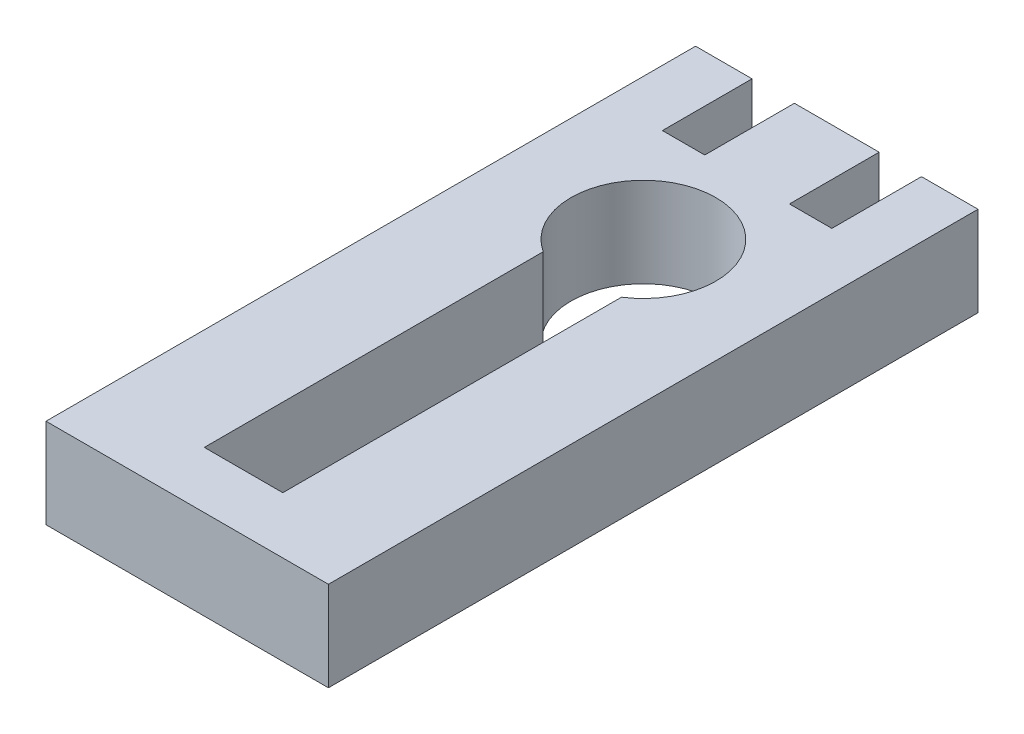
ISO-10303-21;
HEADER;
FILE_DESCRIPTION(('STEP AP214'),'2;1');
FILE_NAME('part.step','',(''),(''),'','','');
FILE_SCHEMA(('AUTOMOTIVE_DESIGN { 1 0 10303 214 1 1 1 1 }'));
ENDSEC;
DATA;
#1=APPLICATION_CONTEXT('core data for automotive mechanical design processes');
#2=APPLICATION_PROTOCOL_DEFINITION('international standard','automotive_design',2000,#1);
#3=PRODUCT_CONTEXT('',#1,'mechanical');
#4=PRODUCT('Part','Part','',(#3));
#5=PRODUCT_RELATED_PRODUCT_CATEGORY('part','',(#4));
#6=PRODUCT_DEFINITION_FORMATION('','',#4);
#7=PRODUCT_DEFINITION_CONTEXT('part definition',#1,'design');
#8=PRODUCT_DEFINITION('design','',#6,#7);
#9=PRODUCT_DEFINITION_SHAPE('','',#8);
#10=(LENGTH_UNIT() NAMED_UNIT(*) SI_UNIT(.MILLI.,.METRE.));
#11=(NAMED_UNIT(*) PLANE_ANGLE_UNIT() SI_UNIT($,.RADIAN.));
#12=(NAMED_UNIT(*) SI_UNIT($,.STERADIAN.) SOLID_ANGLE_UNIT());
#13=UNCERTAINTY_MEASURE_WITH_UNIT(LENGTH_MEASURE(1.E-05),#10,'distance_accuracy_value','');
#14=(GEOMETRIC_REPRESENTATION_CONTEXT(3) GLOBAL_UNCERTAINTY_ASSIGNED_CONTEXT((#13)) GLOBAL_UNIT_ASSIGNED_CONTEXT((#10,
#11,#12)) REPRESENTATION_CONTEXT('',''));
#15=CARTESIAN_POINT('',(0.,0.,0.));
#16=DIRECTION('',(0.,0.,1.));
#17=DIRECTION('',(1.,0.,0.));
#18=AXIS2_PLACEMENT_3D('',#15,#16,#17);
#19=CARTESIAN_POINT('',(0.,3.175,0.));
#20=DIRECTION('',(1.,0.,0.));
#21=DIRECTION('',(0.,0.,-1.));
#22=AXIS2_PLACEMENT_3D('',#19,#20,#21);
#23=PLANE('',#22);
#24=DIRECTION('',(0.,0.,1.));
#25=VECTOR('',#24,1.);
#26=CARTESIAN_POINT('',(0.,0.,0.));
#27=LINE('',#26,#25);
#28=CARTESIAN_POINT('',(0.,0.,-23.));
#29=VERTEX_POINT('',#28);
#30=CARTESIAN_POINT('',(0.,0.,0.));
#31=VERTEX_POINT('',#30);
#32=EDGE_CURVE('E151',#29,#31,#27,.T.);
#33=ORIENTED_EDGE('',*,*,#32,.T.);
#34=DIRECTION('',(0.,-1.,0.));
#35=VECTOR('',#34,1.);
#36=CARTESIAN_POINT('',(0.,3.175,0.));
#37=LINE('',#36,#35);
#38=CARTESIAN_POINT('',(0.,3.175,0.));
#39=VERTEX_POINT('',#38);
#40=EDGE_CURVE('E11',#39,#31,#37,.T.);
#41=ORIENTED_EDGE('',*,*,#40,.F.);
#42=DIRECTION('',(0.,0.,1.));
#43=VECTOR('',#42,1.);
#44=CARTESIAN_POINT('',(0.,3.175,0.));
#45=LINE('',#44,#43);
#46=CARTESIAN_POINT('',(0.,3.175,-23.));
#47=VERTEX_POINT('',#46);
#48=EDGE_CURVE('E180',#47,#39,#45,.T.);
#49=ORIENTED_EDGE('',*,*,#48,.F.);
#50=DIRECTION('',(0.,-1.,0.));
#51=VECTOR('',#50,1.);
#52=CARTESIAN_POINT('',(0.,3.175,-23.));
#53=LINE('',#52,#51);
#54=EDGE_CURVE('E206',#47,#29,#53,.T.);
#55=ORIENTED_EDGE('',*,*,#54,.T.);
#56=EDGE_LOOP('',(#33,#41,#49,#55));
#57=FACE_BOUND('',#56,.T.);
#58=ADVANCED_FACE('F33',(#57),#23,.F.);
#59=CARTESIAN_POINT('',(0.,3.175,0.));
#60=DIRECTION('',(0.,0.,-1.));
#61=DIRECTION('',(-1.,0.,0.));
#62=AXIS2_PLACEMENT_3D('',#59,#60,#61);
#63=PLANE('',#62);
#64=DIRECTION('',(1.,0.,0.));
#65=VECTOR('',#64,1.);
#66=CARTESIAN_POINT('',(0.,0.,0.));
#67=LINE('',#66,#65);
#68=CARTESIAN_POINT('',(10.,0.,0.));
#69=VERTEX_POINT('',#68);
#70=EDGE_CURVE('E209',#31,#69,#67,.T.);
#71=ORIENTED_EDGE('',*,*,#70,.T.);
#72=DIRECTION('',(0.,-1.,0.));
#73=VECTOR('',#72,1.);
#74=CARTESIAN_POINT('',(10.,3.175,0.));
#75=LINE('',#74,#73);
#76=CARTESIAN_POINT('',(10.,3.175,0.));
#77=VERTEX_POINT('',#76);
#78=EDGE_CURVE('E40',#77,#69,#75,.T.);
#79=ORIENTED_EDGE('',*,*,#78,.F.);
#80=DIRECTION('',(1.,0.,0.));
#81=VECTOR('',#80,1.);
#82=CARTESIAN_POINT('',(0.,3.175,0.));
#83=LINE('',#82,#81);
#84=EDGE_CURVE('E183',#39,#77,#83,.T.);
#85=ORIENTED_EDGE('',*,*,#84,.F.);
#86=ORIENTED_EDGE('',*,*,#40,.T.);
#87=EDGE_LOOP('',(#71,#79,#85,#86));
#88=FACE_BOUND('',#87,.T.);
#89=ADVANCED_FACE('F284',(#88),#63,.F.);
#90=CARTESIAN_POINT('',(10.,3.175,0.));
#91=DIRECTION('',(-1.,0.,0.));
#92=DIRECTION('',(0.,0.,1.));
#93=AXIS2_PLACEMENT_3D('',#90,#91,#92);
#94=PLANE('',#93);
#95=DIRECTION('',(0.,0.,-1.));
#96=VECTOR('',#95,1.);
#97=CARTESIAN_POINT('',(10.,0.,0.));
#98=LINE('',#97,#96);
#99=CARTESIAN_POINT('',(10.,0.,-23.));
#100=VERTEX_POINT('',#99);
#101=EDGE_CURVE('E211',#69,#100,#98,.T.);
#102=ORIENTED_EDGE('',*,*,#101,.T.);
#103=DIRECTION('',(0.,-1.,0.));
#104=VECTOR('',#103,1.);
#105=CARTESIAN_POINT('',(10.,3.175,-23.));
#106=LINE('',#105,#104);
#107=CARTESIAN_POINT('',(10.,3.175,-23.));
#108=VERTEX_POINT('',#107);
#109=EDGE_CURVE('E256',#108,#100,#106,.T.);
#110=ORIENTED_EDGE('',*,*,#109,.F.);
#111=DIRECTION('',(0.,0.,-1.));
#112=VECTOR('',#111,1.);
#113=CARTESIAN_POINT('',(10.,3.175,0.));
#114=LINE('',#113,#112);
#115=EDGE_CURVE('E186',#77,#108,#114,.T.);
#116=ORIENTED_EDGE('',*,*,#115,.F.);
#117=ORIENTED_EDGE('',*,*,#78,.T.);
#118=EDGE_LOOP('',(#102,#110,#116,#117));
#119=FACE_BOUND('',#118,.T.);
#120=ADVANCED_FACE('F263',(#119),#94,.F.);
#121=CARTESIAN_POINT('',(10.,3.175,-23.));
#122=DIRECTION('',(0.,0.,1.));
#123=DIRECTION('',(1.,0.,0.));
#124=AXIS2_PLACEMENT_3D('',#121,#122,#123);
#125=PLANE('',#124);
#126=DIRECTION('',(-1.,0.,0.));
#127=VECTOR('',#126,1.);
#128=CARTESIAN_POINT('',(10.,0.,-23.));
#129=LINE('',#128,#127);
#130=CARTESIAN_POINT('',(8.,0.,-23.));
#131=VERTEX_POINT('',#130);
#132=EDGE_CURVE('E213',#100,#131,#129,.T.);
#133=ORIENTED_EDGE('',*,*,#132,.T.);
#134=DIRECTION('',(0.,-1.,0.));
#135=VECTOR('',#134,1.);
#136=CARTESIAN_POINT('',(8.,3.175,-23.));
#137=LINE('',#136,#135);
#138=CARTESIAN_POINT('',(8.,3.175,-23.));
#139=VERTEX_POINT('',#138);
#140=EDGE_CURVE('E253',#139,#131,#137,.T.);
#141=ORIENTED_EDGE('',*,*,#140,.F.);
#142=DIRECTION('',(-1.,0.,0.));
#143=VECTOR('',#142,1.);
#144=CARTESIAN_POINT('',(10.,3.175,-23.));
#145=LINE('',#144,#143);
#146=EDGE_CURVE('E188',#108,#139,#145,.T.);
#147=ORIENTED_EDGE('',*,*,#146,.F.);
#148=ORIENTED_EDGE('',*,*,#109,.T.);
#149=EDGE_LOOP('',(#133,#141,#147,#148));
#150=FACE_BOUND('',#149,.T.);
#151=ADVANCED_FACE('F272',(#150),#125,.F.);
#152=CARTESIAN_POINT('',(8.,3.175,-23.));
#153=DIRECTION('',(1.,0.,0.));
#154=DIRECTION('',(0.,0.,-1.));
#155=AXIS2_PLACEMENT_3D('',#152,#153,#154);
#156=PLANE('',#155);
#157=DIRECTION('',(0.,0.,1.));
#158=VECTOR('',#157,1.);
#159=CARTESIAN_POINT('',(8.,0.,-23.));
#160=LINE('',#159,#158);
#161=CARTESIAN_POINT('',(8.,0.,-19.825));
#162=VERTEX_POINT('',#161);
#163=EDGE_CURVE('E215',#131,#162,#160,.T.);
#164=ORIENTED_EDGE('',*,*,#163,.T.);
#165=DIRECTION('',(0.,-1.,0.));
#166=VECTOR('',#165,1.);
#167=CARTESIAN_POINT('',(8.,3.175,-19.825));
#168=LINE('',#167,#166);
#169=CARTESIAN_POINT('',(8.,3.175,-19.825));
#170=VERTEX_POINT('',#169);
#171=EDGE_CURVE('E250',#170,#162,#168,.T.);
#172=ORIENTED_EDGE('',*,*,#171,.F.);
#173=DIRECTION('',(0.,0.,1.));
#174=VECTOR('',#173,1.);
#175=CARTESIAN_POINT('',(8.,3.175,-23.));
#176=LINE('',#175,#174);
#177=EDGE_CURVE('E190',#139,#170,#176,.T.);
#178=ORIENTED_EDGE('',*,*,#177,.F.);
#179=ORIENTED_EDGE('',*,*,#140,.T.);
#180=EDGE_LOOP('',(#164,#172,#178,#179));
#181=FACE_BOUND('',#180,.T.);
#182=ADVANCED_FACE('F276',(#181),#156,.F.);
#183=CARTESIAN_POINT('',(8.,3.175,-19.825));
#184=DIRECTION('',(0.,0.,1.));
#185=DIRECTION('',(1.,0.,0.));
#186=AXIS2_PLACEMENT_3D('',#183,#184,#185);
#187=PLANE('',#186);
#188=DIRECTION('',(-1.,0.,0.));
#189=VECTOR('',#188,1.);
#190=CARTESIAN_POINT('',(8.,0.,-19.825));
#191=LINE('',#190,#189);
#192=CARTESIAN_POINT('',(6.5,0.,-19.825));
#193=VERTEX_POINT('',#192);
#194=EDGE_CURVE('E217',#162,#193,#191,.T.);
#195=ORIENTED_EDGE('',*,*,#194,.T.);
#196=DIRECTION('',(0.,-1.,0.));
#197=VECTOR('',#196,1.);
#198=CARTESIAN_POINT('',(6.5,3.175,-19.825));
#199=LINE('',#198,#197);
#200=CARTESIAN_POINT('',(6.5,3.175,-19.825));
#201=VERTEX_POINT('',#200);
#202=EDGE_CURVE('E247',#201,#193,#199,.T.);
#203=ORIENTED_EDGE('',*,*,#202,.F.);
#204=DIRECTION('',(-1.,0.,0.));
#205=VECTOR('',#204,1.);
#206=CARTESIAN_POINT('',(8.,3.175,-19.825));
#207=LINE('',#206,#205);
#208=EDGE_CURVE('E192',#170,#201,#207,.T.);
#209=ORIENTED_EDGE('',*,*,#208,.F.);
#210=ORIENTED_EDGE('',*,*,#171,.T.);
#211=EDGE_LOOP('',(#195,#203,#209,#210));
#212=FACE_BOUND('',#211,.T.);
#213=ADVANCED_FACE('F317',(#212),#187,.F.);
#214=CARTESIAN_POINT('',(6.5,3.175,-23.));
#215=DIRECTION('',(-1.,0.,0.));
#216=DIRECTION('',(0.,0.,1.));
#217=AXIS2_PLACEMENT_3D('',#214,#215,#216);
#218=PLANE('',#217);
#219=DIRECTION('',(0.,0.,-1.));
#220=VECTOR('',#219,1.);
#221=CARTESIAN_POINT('',(6.5,0.,-23.));
#222=LINE('',#221,#220);
#223=CARTESIAN_POINT('',(6.5,0.,-23.));
#224=VERTEX_POINT('',#223);
#225=EDGE_CURVE('E219',#193,#224,#222,.T.);
#226=ORIENTED_EDGE('',*,*,#225,.T.);
#227=DIRECTION('',(0.,-1.,0.));
#228=VECTOR('',#227,1.);
#229=CARTESIAN_POINT('',(6.5,3.175,-23.));
#230=LINE('',#229,#228);
#231=CARTESIAN_POINT('',(6.5,3.175,-23.));
#232=VERTEX_POINT('',#231);
#233=EDGE_CURVE('E244',#232,#224,#230,.T.);
#234=ORIENTED_EDGE('',*,*,#233,.F.);
#235=DIRECTION('',(0.,0.,-1.));
#236=VECTOR('',#235,1.);
#237=CARTESIAN_POINT('',(6.5,3.175,-23.));
#238=LINE('',#237,#236);
#239=EDGE_CURVE('E194',#201,#232,#238,.T.);
#240=ORIENTED_EDGE('',*,*,#239,.F.);
#241=ORIENTED_EDGE('',*,*,#202,.T.);
#242=EDGE_LOOP('',(#226,#234,#240,#241));
#243=FACE_BOUND('',#242,.T.);
#244=ADVANCED_FACE('F315',(#243),#218,.F.);
#245=CARTESIAN_POINT('',(3.5,3.175,-23.));
#246=DIRECTION('',(0.,0.,1.));
#247=DIRECTION('',(1.,0.,0.));
#248=AXIS2_PLACEMENT_3D('',#245,#246,#247);
#249=PLANE('',#248);
#250=DIRECTION('',(-1.,0.,0.));
#251=VECTOR('',#250,1.);
#252=CARTESIAN_POINT('',(3.5,0.,-23.));
#253=LINE('',#252,#251);
#254=CARTESIAN_POINT('',(3.5,0.,-23.));
#255=VERTEX_POINT('',#254);
#256=EDGE_CURVE('E221',#224,#255,#253,.T.);
#257=ORIENTED_EDGE('',*,*,#256,.T.);
#258=DIRECTION('',(0.,-1.,0.));
#259=VECTOR('',#258,1.);
#260=CARTESIAN_POINT('',(3.5,3.175,-23.));
#261=LINE('',#260,#259);
#262=CARTESIAN_POINT('',(3.5,3.175,-23.));
#263=VERTEX_POINT('',#262);
#264=EDGE_CURVE('E241',#263,#255,#261,.T.);
#265=ORIENTED_EDGE('',*,*,#264,.F.);
#266=DIRECTION('',(-1.,0.,0.));
#267=VECTOR('',#266,1.);
#268=CARTESIAN_POINT('',(3.5,3.175,-23.));
#269=LINE('',#268,#267);
#270=EDGE_CURVE('E196',#232,#263,#269,.T.);
#271=ORIENTED_EDGE('',*,*,#270,.F.);
#272=ORIENTED_EDGE('',*,*,#233,.T.);
#273=EDGE_LOOP('',(#257,#265,#271,#272));
#274=FACE_BOUND('',#273,.T.);
#275=ADVANCED_FACE('F311',(#274),#249,.F.);
#276=CARTESIAN_POINT('',(3.5,3.175,-23.));
#277=DIRECTION('',(1.,0.,0.));
#278=DIRECTION('',(0.,0.,-1.));
#279=AXIS2_PLACEMENT_3D('',#276,#277,#278);
#280=PLANE('',#279);
#281=DIRECTION('',(0.,0.,1.));
#282=VECTOR('',#281,1.);
#283=CARTESIAN_POINT('',(3.5,0.,-23.));
#284=LINE('',#283,#282);
#285=CARTESIAN_POINT('',(3.5,0.,-19.825));
#286=VERTEX_POINT('',#285);
#287=EDGE_CURVE('E223',#255,#286,#284,.T.);
#288=ORIENTED_EDGE('',*,*,#287,.T.);
#289=DIRECTION('',(0.,-1.,0.));
#290=VECTOR('',#289,1.);
#291=CARTESIAN_POINT('',(3.5,3.175,-19.825));
#292=LINE('',#291,#290);
#293=CARTESIAN_POINT('',(3.5,3.175,-19.825));
#294=VERTEX_POINT('',#293);
#295=EDGE_CURVE('E238',#294,#286,#292,.T.);
#296=ORIENTED_EDGE('',*,*,#295,.F.);
#297=DIRECTION('',(0.,0.,1.));
#298=VECTOR('',#297,1.);
#299=CARTESIAN_POINT('',(3.5,3.175,-23.));
#300=LINE('',#299,#298);
#301=EDGE_CURVE('E198',#263,#294,#300,.T.);
#302=ORIENTED_EDGE('',*,*,#301,.F.);
#303=ORIENTED_EDGE('',*,*,#264,.T.);
#304=EDGE_LOOP('',(#288,#296,#302,#303));
#305=FACE_BOUND('',#304,.T.);
#306=ADVANCED_FACE('F306',(#305),#280,.F.);
#307=CARTESIAN_POINT('',(2.,3.175,-19.825));
#308=DIRECTION('',(0.,0.,1.));
#309=DIRECTION('',(1.,0.,0.));
#310=AXIS2_PLACEMENT_3D('',#307,#308,#309);
#311=PLANE('',#310);
#312=DIRECTION('',(-1.,0.,0.));
#313=VECTOR('',#312,1.);
#314=CARTESIAN_POINT('',(2.,0.,-19.825));
#315=LINE('',#314,#313);
#316=CARTESIAN_POINT('',(2.,0.,-19.825));
#317=VERTEX_POINT('',#316);
#318=EDGE_CURVE('E225',#286,#317,#315,.T.);
#319=ORIENTED_EDGE('',*,*,#318,.T.);
#320=DIRECTION('',(0.,-1.,0.));
#321=VECTOR('',#320,1.);
#322=CARTESIAN_POINT('',(2.,3.175,-19.825));
#323=LINE('',#322,#321);
#324=CARTESIAN_POINT('',(2.,3.175,-19.825));
#325=VERTEX_POINT('',#324);
#326=EDGE_CURVE('E235',#325,#317,#323,.T.);
#327=ORIENTED_EDGE('',*,*,#326,.F.);
#328=DIRECTION('',(-1.,0.,0.));
#329=VECTOR('',#328,1.);
#330=CARTESIAN_POINT('',(2.,3.175,-19.825));
#331=LINE('',#330,#329);
#332=EDGE_CURVE('E200',#294,#325,#331,.T.);
#333=ORIENTED_EDGE('',*,*,#332,.F.);
#334=ORIENTED_EDGE('',*,*,#295,.T.);
#335=EDGE_LOOP('',(#319,#327,#333,#334));
#336=FACE_BOUND('',#335,.T.);
#337=ADVANCED_FACE('F300',(#336),#311,.F.);
#338=CARTESIAN_POINT('',(2.,3.175,-23.));
#339=DIRECTION('',(-1.,0.,0.));
#340=DIRECTION('',(0.,0.,1.));
#341=AXIS2_PLACEMENT_3D('',#338,#339,#340);
#342=PLANE('',#341);
#343=DIRECTION('',(0.,0.,-1.));
#344=VECTOR('',#343,1.);
#345=CARTESIAN_POINT('',(2.,0.,-23.));
#346=LINE('',#345,#344);
#347=CARTESIAN_POINT('',(2.,0.,-23.));
#348=VERTEX_POINT('',#347);
#349=EDGE_CURVE('E227',#317,#348,#346,.T.);
#350=ORIENTED_EDGE('',*,*,#349,.T.);
#351=DIRECTION('',(0.,-1.,0.));
#352=VECTOR('',#351,1.);
#353=CARTESIAN_POINT('',(2.,3.175,-23.));
#354=LINE('',#353,#352);
#355=CARTESIAN_POINT('',(2.,3.175,-23.));
#356=VERTEX_POINT('',#355);
#357=EDGE_CURVE('E232',#356,#348,#354,.T.);
#358=ORIENTED_EDGE('',*,*,#357,.F.);
#359=DIRECTION('',(0.,0.,-1.));
#360=VECTOR('',#359,1.);
#361=CARTESIAN_POINT('',(2.,3.175,-23.));
#362=LINE('',#361,#360);
#363=EDGE_CURVE('E202',#325,#356,#362,.T.);
#364=ORIENTED_EDGE('',*,*,#363,.F.);
#365=ORIENTED_EDGE('',*,*,#326,.T.);
#366=EDGE_LOOP('',(#350,#358,#364,#365));
#367=FACE_BOUND('',#366,.T.);
#368=ADVANCED_FACE('F296',(#367),#342,.F.);
#369=CARTESIAN_POINT('',(0.,3.175,-23.));
#370=DIRECTION('',(0.,0.,1.));
#371=DIRECTION('',(1.,0.,0.));
#372=AXIS2_PLACEMENT_3D('',#369,#370,#371);
#373=PLANE('',#372);
#374=DIRECTION('',(-1.,0.,0.));
#375=VECTOR('',#374,1.);
#376=CARTESIAN_POINT('',(0.,0.,-23.));
#377=LINE('',#376,#375);
#378=EDGE_CURVE('E184',#348,#29,#377,.T.);
#379=ORIENTED_EDGE('',*,*,#378,.T.);
#380=ORIENTED_EDGE('',*,*,#54,.F.);
#381=DIRECTION('',(-1.,0.,0.));
#382=VECTOR('',#381,1.);
#383=CARTESIAN_POINT('',(0.,3.175,-23.));
#384=LINE('',#383,#382);
#385=EDGE_CURVE('E204',#356,#47,#384,.T.);
#386=ORIENTED_EDGE('',*,*,#385,.F.);
#387=ORIENTED_EDGE('',*,*,#357,.T.);
#388=EDGE_LOOP('',(#379,#380,#386,#387));
#389=FACE_BOUND('',#388,.T.);
#390=ADVANCED_FACE('F291',(#389),#373,.F.);
#391=CARTESIAN_POINT('',(0.,3.175,0.));
#392=DIRECTION('',(0.,-1.,0.));
#393=DIRECTION('',(0.,0.,-1.));
#394=AXIS2_PLACEMENT_3D('',#391,#392,#393);
#395=PLANE('',#394);
#396=DIRECTION('',(0.,0.,1.));
#397=VECTOR('',#396,1.);
#398=CARTESIAN_POINT('',(3.60499999999999,3.175,-14.));
#399=LINE('',#398,#397);
#400=CARTESIAN_POINT('',(3.60499999999999,3.175,-14.));
#401=VERTEX_POINT('',#400);
#402=CARTESIAN_POINT('',(3.60499999999999,3.175,-2.));
#403=VERTEX_POINT('',#402);
#404=EDGE_CURVE('E164',#401,#403,#399,.T.);
#405=ORIENTED_EDGE('',*,*,#404,.F.);
#406=CARTESIAN_POINT('',(4.99999999999999,3.175,-16.1524869337583));
#407=DIRECTION('',(0.,1.,0.));
#408=DIRECTION('',(0.,0.,-1.));
#409=AXIS2_PLACEMENT_3D('',#406,#407,#408);
#410=CIRCLE('',#409,2.565);
#411=CARTESIAN_POINT('',(6.38499999999999,3.175,-13.9935520111633));
#412=VERTEX_POINT('',#411);
#413=EDGE_CURVE('E47',#412,#401,#410,.T.);
#414=ORIENTED_EDGE('',*,*,#413,.F.);
#415=DIRECTION('',(0.,0.,-1.));
#416=VECTOR('',#415,1.);
#417=CARTESIAN_POINT('',(6.38499999999999,3.175,-13.9935520111633));
#418=LINE('',#417,#416);
#419=CARTESIAN_POINT('',(6.38499999999999,3.175,-2.));
#420=VERTEX_POINT('',#419);
#421=EDGE_CURVE('E157',#420,#412,#418,.T.);
#422=ORIENTED_EDGE('',*,*,#421,.F.);
#423=DIRECTION('',(1.,0.,0.));
#424=VECTOR('',#423,1.);
#425=CARTESIAN_POINT('',(3.60499999999999,3.175,-2.));
#426=LINE('',#425,#424);
#427=EDGE_CURVE('E171',#403,#420,#426,.T.);
#428=ORIENTED_EDGE('',*,*,#427,.F.);
#429=EDGE_LOOP('',(#405,#414,#422,#428));
#430=FACE_BOUND('',#429,.T.);
#431=ORIENTED_EDGE('',*,*,#48,.T.);
#432=ORIENTED_EDGE('',*,*,#84,.T.);
#433=ORIENTED_EDGE('',*,*,#115,.T.);
#434=ORIENTED_EDGE('',*,*,#146,.T.);
#435=ORIENTED_EDGE('',*,*,#177,.T.);
#436=ORIENTED_EDGE('',*,*,#208,.T.);
#437=ORIENTED_EDGE('',*,*,#239,.T.);
#438=ORIENTED_EDGE('',*,*,#270,.T.);
#439=ORIENTED_EDGE('',*,*,#301,.T.);
#440=ORIENTED_EDGE('',*,*,#332,.T.);
#441=ORIENTED_EDGE('',*,*,#363,.T.);
#442=ORIENTED_EDGE('',*,*,#385,.T.);
#443=EDGE_LOOP('',(#431,#432,#433,#434,#435,#436,#437,#438,#439,#440,#441,#442));
#444=FACE_BOUND('',#443,.T.);
#445=ADVANCED_FACE('F280',(#430,#444),#395,.F.);
#446=CARTESIAN_POINT('',(0.,0.,0.));
#447=DIRECTION('',(0.,-1.,0.));
#448=DIRECTION('',(0.,0.,-1.));
#449=AXIS2_PLACEMENT_3D('',#446,#447,#448);
#450=PLANE('',#449);
#451=CARTESIAN_POINT('',(4.99999999999999,0.,-16.1524869337583));
#452=DIRECTION('',(0.,-1.,0.));
#453=DIRECTION('',(0.,0.,-1.));
#454=AXIS2_PLACEMENT_3D('',#451,#452,#453);
#455=CIRCLE('',#454,2.565);
#456=CARTESIAN_POINT('',(6.38499999999999,0.,-13.9935520111633));
#457=VERTEX_POINT('',#456);
#458=CARTESIAN_POINT('',(3.60499999999999,0.,-14.));
#459=VERTEX_POINT('',#458);
#460=EDGE_CURVE('E155',#457,#459,#455,.F.);
#461=ORIENTED_EDGE('',*,*,#460,.T.);
#462=DIRECTION('',(0.,0.,1.));
#463=VECTOR('',#462,1.);
#464=CARTESIAN_POINT('',(3.60499999999999,0.,-14.));
#465=LINE('',#464,#463);
#466=CARTESIAN_POINT('',(3.60499999999999,0.,-2.));
#467=VERTEX_POINT('',#466);
#468=EDGE_CURVE('E144',#459,#467,#465,.T.);
#469=ORIENTED_EDGE('',*,*,#468,.T.);
#470=DIRECTION('',(1.,0.,0.));
#471=VECTOR('',#470,1.);
#472=CARTESIAN_POINT('',(3.60499999999999,0.,-2.));
#473=LINE('',#472,#471);
#474=CARTESIAN_POINT('',(6.38499999999999,0.,-2.));
#475=VERTEX_POINT('',#474);
#476=EDGE_CURVE('E166',#467,#475,#473,.T.);
#477=ORIENTED_EDGE('',*,*,#476,.T.);
#478=DIRECTION('',(0.,0.,-1.));
#479=VECTOR('',#478,1.);
#480=CARTESIAN_POINT('',(6.38499999999999,0.,-13.9935520111633));
#481=LINE('',#480,#479);
#482=EDGE_CURVE('E162',#475,#457,#481,.T.);
#483=ORIENTED_EDGE('',*,*,#482,.T.);
#484=EDGE_LOOP('',(#461,#469,#477,#483));
#485=FACE_BOUND('',#484,.T.);
#486=ORIENTED_EDGE('',*,*,#32,.F.);
#487=ORIENTED_EDGE('',*,*,#378,.F.);
#488=ORIENTED_EDGE('',*,*,#349,.F.);
#489=ORIENTED_EDGE('',*,*,#318,.F.);
#490=ORIENTED_EDGE('',*,*,#287,.F.);
#491=ORIENTED_EDGE('',*,*,#256,.F.);
#492=ORIENTED_EDGE('',*,*,#225,.F.);
#493=ORIENTED_EDGE('',*,*,#194,.F.);
#494=ORIENTED_EDGE('',*,*,#163,.F.);
#495=ORIENTED_EDGE('',*,*,#132,.F.);
#496=ORIENTED_EDGE('',*,*,#101,.F.);
#497=ORIENTED_EDGE('',*,*,#70,.F.);
#498=EDGE_LOOP('',(#486,#487,#488,#489,#490,#491,#492,#493,#494,#495,#496,#497));
#499=FACE_BOUND('',#498,.T.);
#500=ADVANCED_FACE('F160',(#485,#499),#450,.T.);
#501=CARTESIAN_POINT('',(4.99999999999999,-0.00100000000000013,-16.1524869337583));
#502=DIRECTION('',(0.,1.,0.));
#503=DIRECTION('',(0.,0.,1.));
#504=AXIS2_PLACEMENT_3D('',#501,#502,#503);
#505=CYLINDRICAL_SURFACE('',#504,2.565);
#506=DIRECTION('',(0.,1.,0.));
#507=VECTOR('',#506,1.);
#508=CARTESIAN_POINT('',(6.38499999999999,-0.00100000000000013,-13.9935520111633));
#509=LINE('',#508,#507);
#510=EDGE_CURVE('E152',#457,#412,#509,.T.);
#511=ORIENTED_EDGE('',*,*,#510,.T.);
#512=ORIENTED_EDGE('',*,*,#413,.T.);
#513=DIRECTION('',(0.,1.,0.));
#514=VECTOR('',#513,1.);
#515=CARTESIAN_POINT('',(3.60499999999999,-0.00100000000000013,-14.));
#516=LINE('',#515,#514);
#517=EDGE_CURVE('E146',#459,#401,#516,.T.);
#518=ORIENTED_EDGE('',*,*,#517,.F.);
#519=ORIENTED_EDGE('',*,*,#460,.F.);
#520=EDGE_LOOP('',(#511,#512,#518,#519));
#521=FACE_BOUND('',#520,.T.);
#522=ADVANCED_FACE('F154',(#521),#505,.F.);
#523=CARTESIAN_POINT('',(6.38499999999999,-0.00100000000000013,-13.9935520111633));
#524=DIRECTION('',(1.,0.,0.));
#525=DIRECTION('',(0.,0.,-1.));
#526=AXIS2_PLACEMENT_3D('',#523,#524,#525);
#527=PLANE('',#526);
#528=DIRECTION('',(0.,1.,0.));
#529=VECTOR('',#528,1.);
#530=CARTESIAN_POINT('',(6.38499999999999,-0.00100000000000013,-2.));
#531=LINE('',#530,#529);
#532=EDGE_CURVE('E177',#475,#420,#531,.T.);
#533=ORIENTED_EDGE('',*,*,#532,.T.);
#534=ORIENTED_EDGE('',*,*,#421,.T.);
#535=ORIENTED_EDGE('',*,*,#510,.F.);
#536=ORIENTED_EDGE('',*,*,#482,.F.);
#537=EDGE_LOOP('',(#533,#534,#535,#536));
#538=FACE_BOUND('',#537,.T.);
#539=ADVANCED_FACE('F420',(#538),#527,.F.);
#540=CARTESIAN_POINT('',(3.60499999999999,-0.00100000000000013,-2.));
#541=DIRECTION('',(0.,0.,1.));
#542=DIRECTION('',(1.,0.,0.));
#543=AXIS2_PLACEMENT_3D('',#540,#541,#542);
#544=PLANE('',#543);
#545=DIRECTION('',(0.,1.,0.));
#546=VECTOR('',#545,1.);
#547=CARTESIAN_POINT('',(3.60499999999999,-0.00100000000000013,-2.));
#548=LINE('',#547,#546);
#549=EDGE_CURVE('E55',#467,#403,#548,.T.);
#550=ORIENTED_EDGE('',*,*,#549,.T.);
#551=ORIENTED_EDGE('',*,*,#427,.T.);
#552=ORIENTED_EDGE('',*,*,#532,.F.);
#553=ORIENTED_EDGE('',*,*,#476,.F.);
#554=EDGE_LOOP('',(#550,#551,#552,#553));
#555=FACE_BOUND('',#554,.T.);
#556=ADVANCED_FACE('F429',(#555),#544,.F.);
#557=CARTESIAN_POINT('',(3.60499999999999,-0.00100000000000013,-14.));
#558=DIRECTION('',(-1.,0.,0.));
#559=DIRECTION('',(0.,0.,1.));
#560=AXIS2_PLACEMENT_3D('',#557,#558,#559);
#561=PLANE('',#560);
#562=ORIENTED_EDGE('',*,*,#517,.T.);
#563=ORIENTED_EDGE('',*,*,#404,.T.);
#564=ORIENTED_EDGE('',*,*,#549,.F.);
#565=ORIENTED_EDGE('',*,*,#468,.F.);
#566=EDGE_LOOP('',(#562,#563,#564,#565));
#567=FACE_BOUND('',#566,.T.);
#568=ADVANCED_FACE('F145',(#567),#561,.F.);
#569=CLOSED_SHELL('',(#58,#89,#120,#151,#182,#213,#244,#275,#306,#337,#368,#390,#445,#500,#522,
#539,#556,#568));
#570=MANIFOLD_SOLID_BREP('B2',#569);
#571=ADVANCED_BREP_SHAPE_REPRESENTATION('',(#18,#570),#14);
#572=SHAPE_DEFINITION_REPRESENTATION(#9,#571);
ENDSEC;
END-ISO-10303-21;
